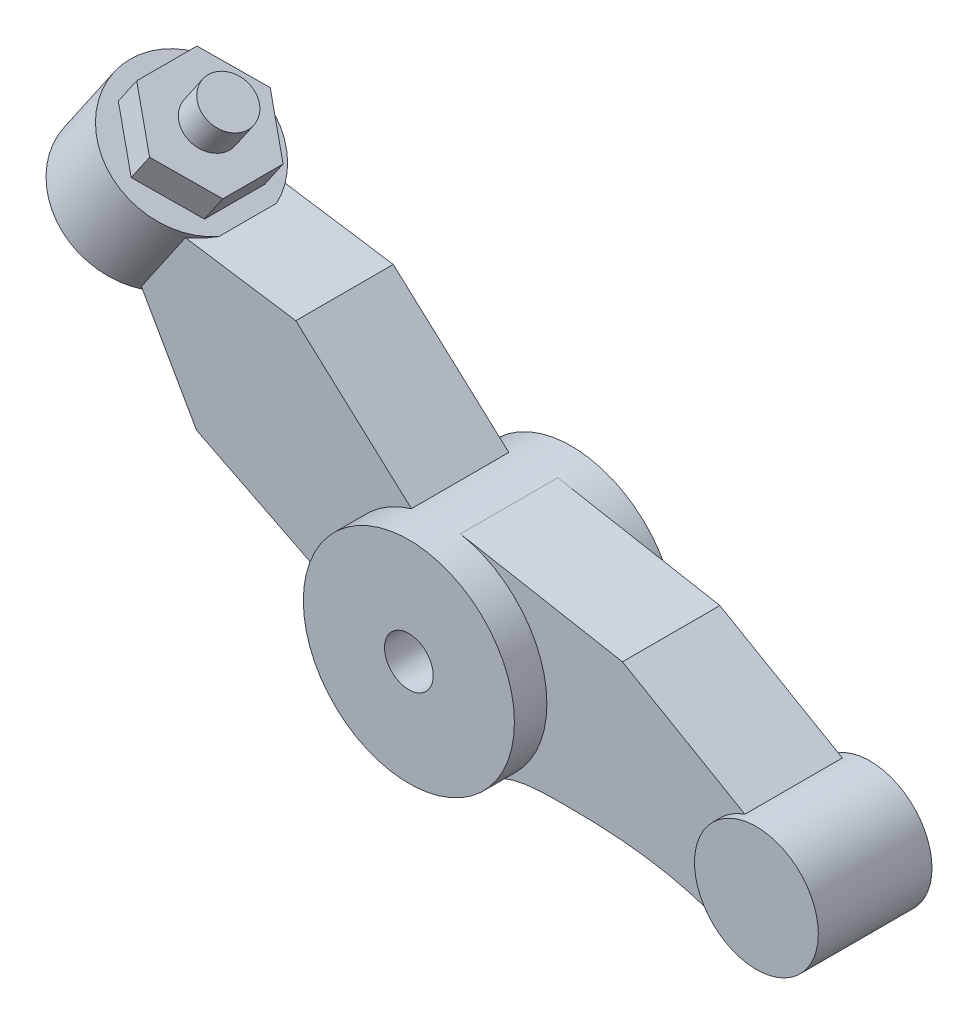
ISO-10303-21;
HEADER;
FILE_DESCRIPTION(('STEP AP214'),'2;1');
FILE_NAME('part.step','',(''),(''),'','','');
FILE_SCHEMA(('AUTOMOTIVE_DESIGN { 1 0 10303 214 1 1 1 1 }'));
ENDSEC;
DATA;
#1=APPLICATION_CONTEXT('core data for automotive mechanical design processes');
#2=APPLICATION_PROTOCOL_DEFINITION('international standard','automotive_design',2000,#1);
#3=PRODUCT_CONTEXT('',#1,'mechanical');
#4=PRODUCT('Part','Part','',(#3));
#5=PRODUCT_RELATED_PRODUCT_CATEGORY('part','',(#4));
#6=PRODUCT_DEFINITION_FORMATION('','',#4);
#7=PRODUCT_DEFINITION_CONTEXT('part definition',#1,'design');
#8=PRODUCT_DEFINITION('design','',#6,#7);
#9=PRODUCT_DEFINITION_SHAPE('','',#8);
#10=(LENGTH_UNIT() NAMED_UNIT(*) SI_UNIT(.MILLI.,.METRE.));
#11=(NAMED_UNIT(*) PLANE_ANGLE_UNIT() SI_UNIT($,.RADIAN.));
#12=(NAMED_UNIT(*) SI_UNIT($,.STERADIAN.) SOLID_ANGLE_UNIT());
#13=UNCERTAINTY_MEASURE_WITH_UNIT(LENGTH_MEASURE(1.E-05),#10,'distance_accuracy_value','');
#14=(GEOMETRIC_REPRESENTATION_CONTEXT(3) GLOBAL_UNCERTAINTY_ASSIGNED_CONTEXT((#13)) GLOBAL_UNIT_ASSIGNED_CONTEXT((#10,
#11,#12)) REPRESENTATION_CONTEXT('',''));
#15=CARTESIAN_POINT('',(0.,0.,0.));
#16=DIRECTION('',(0.,0.,1.));
#17=DIRECTION('',(1.,0.,0.));
#18=AXIS2_PLACEMENT_3D('',#15,#16,#17);
#19=CARTESIAN_POINT('',(-4.429411479515,3.71269787290576,0.));
#20=DIRECTION('',(0.565974647839503,0.824422645251178,0.));
#21=DIRECTION('',(-0.824422645251179,0.565974647839503,0.));
#22=AXIS2_PLACEMENT_3D('',#19,#20,#21);
#23=PLANE('',#22);
#24=CARTESIAN_POINT('',(-3.67671360440067,3.1959630194283,0.));
#25=DIRECTION('',(0.565974647839503,0.824422645251178,0.));
#26=DIRECTION('',(-0.824422645251179,0.565974647839503,0.));
#27=AXIS2_PLACEMENT_3D('',#24,#25,#26);
#28=CIRCLE('',#27,0.913);
#29=CARTESIAN_POINT('',(-2.98346453024075,2.72004038087295,-0.355629530954511));
#30=VERTEX_POINT('',#29);
#31=CARTESIAN_POINT('',(-2.98346453024075,2.72004038087295,0.355629530954511));
#32=VERTEX_POINT('',#31);
#33=EDGE_CURVE('E212',#30,#32,#28,.T.);
#34=ORIENTED_EDGE('',*,*,#33,.T.);
#35=DIRECTION('',(0.,0.,-1.));
#36=VECTOR('',#35,1.);
#37=CARTESIAN_POINT('',(-2.98346453024075,2.72004038087295,0.6));
#38=LINE('',#37,#36);
#39=EDGE_CURVE('E42',#32,#30,#38,.T.);
#40=ORIENTED_EDGE('',*,*,#39,.T.);
#41=EDGE_LOOP('',(#34,#40));
#42=FACE_BOUND('',#41,.T.);
#43=DIRECTION('',(0.713970954242686,-0.490148422926961,0.5));
#44=VECTOR('',#43,1.);
#45=CARTESIAN_POINT('',(-4.20707089900953,3.5600587714972,0.371413774928295));
#46=LINE('',#45,#44);
#47=CARTESIAN_POINT('',(-4.20707089900953,3.5600587714972,0.371413774928295));
#48=VERTEX_POINT('',#47);
#49=CARTESIAN_POINT('',(-3.67671360440067,3.1959630194283,0.742827549856588));
#50=VERTEX_POINT('',#49);
#51=EDGE_CURVE('E483',#48,#50,#46,.T.);
#52=ORIENTED_EDGE('',*,*,#51,.F.);
#53=DIRECTION('',(0.,0.,1.));
#54=VECTOR('',#53,1.);
#55=CARTESIAN_POINT('',(-4.20707089900953,3.5600587714972,-0.371413774928294));
#56=LINE('',#55,#54);
#57=CARTESIAN_POINT('',(-4.20707089900953,3.5600587714972,-0.371413774928294));
#58=VERTEX_POINT('',#57);
#59=EDGE_CURVE('E199',#58,#48,#56,.T.);
#60=ORIENTED_EDGE('',*,*,#59,.F.);
#61=DIRECTION('',(-0.713970954242686,0.490148422926961,0.5));
#62=VECTOR('',#61,1.);
#63=CARTESIAN_POINT('',(-3.67671360440067,3.1959630194283,-0.742827549856588));
#64=LINE('',#63,#62);
#65=CARTESIAN_POINT('',(-3.67671360440067,3.1959630194283,-0.742827549856588));
#66=VERTEX_POINT('',#65);
#67=EDGE_CURVE('E195',#66,#58,#64,.T.);
#68=ORIENTED_EDGE('',*,*,#67,.F.);
#69=DIRECTION('',(-0.713970954242687,0.490148422926961,-0.5));
#70=VECTOR('',#69,1.);
#71=CARTESIAN_POINT('',(-3.1463563097918,2.83186726735939,-0.371413774928294));
#72=LINE('',#71,#70);
#73=CARTESIAN_POINT('',(-3.1463563097918,2.83186726735939,-0.371413774928294));
#74=VERTEX_POINT('',#73);
#75=EDGE_CURVE('E498',#74,#66,#72,.T.);
#76=ORIENTED_EDGE('',*,*,#75,.F.);
#77=DIRECTION('',(0.,0.,-1.));
#78=VECTOR('',#77,1.);
#79=CARTESIAN_POINT('',(-3.1463563097918,2.83186726735939,0.371413774928294));
#80=LINE('',#79,#78);
#81=CARTESIAN_POINT('',(-3.1463563097918,2.83186726735939,0.371413774928294));
#82=VERTEX_POINT('',#81);
#83=EDGE_CURVE('E496',#82,#74,#80,.T.);
#84=ORIENTED_EDGE('',*,*,#83,.F.);
#85=DIRECTION('',(0.713970954242687,-0.490148422926961,-0.5));
#86=VECTOR('',#85,1.);
#87=CARTESIAN_POINT('',(-3.67671360440067,3.1959630194283,0.742827549856588));
#88=LINE('',#87,#86);
#89=EDGE_CURVE('E494',#50,#82,#88,.T.);
#90=ORIENTED_EDGE('',*,*,#89,.F.);
#91=EDGE_LOOP('',(#52,#60,#68,#76,#84,#90));
#92=FACE_BOUND('',#91,.T.);
#93=ADVANCED_FACE('F33',(#42,#92),#23,.T.);
#94=CARTESIAN_POINT('',(0.,0.,1.));
#95=DIRECTION('',(0.,0.,-1.));
#96=DIRECTION('',(-1.,0.,0.));
#97=AXIS2_PLACEMENT_3D('',#94,#95,#96);
#98=CYLINDRICAL_SURFACE('',#97,0.3);
#99=CARTESIAN_POINT('',(0.,0.,1.));
#100=DIRECTION('',(0.,0.,1.));
#101=DIRECTION('',(1.,0.,0.));
#102=AXIS2_PLACEMENT_3D('',#99,#100,#101);
#103=CIRCLE('',#102,0.3);
#104=CARTESIAN_POINT('',(0.3,0.,1.));
#105=VERTEX_POINT('',#104);
#106=EDGE_CURVE('E398',#105,#105,#103,.T.);
#107=ORIENTED_EDGE('',*,*,#106,.T.);
#108=EDGE_LOOP('',(#107));
#109=FACE_BOUND('',#108,.T.);
#110=CARTESIAN_POINT('',(0.,0.,-1.));
#111=DIRECTION('',(0.,0.,1.));
#112=DIRECTION('',(1.,0.,0.));
#113=AXIS2_PLACEMENT_3D('',#110,#111,#112);
#114=CIRCLE('',#113,0.3);
#115=CARTESIAN_POINT('',(0.3,0.,-1.));
#116=VERTEX_POINT('',#115);
#117=EDGE_CURVE('E397',#116,#116,#114,.T.);
#118=ORIENTED_EDGE('',*,*,#117,.F.);
#119=EDGE_LOOP('',(#118));
#120=FACE_BOUND('',#119,.T.);
#121=ADVANCED_FACE('F35',(#109,#120),#98,.F.);
#122=CARTESIAN_POINT('',(0.,0.,1.));
#123=DIRECTION('',(0.,0.,-1.));
#124=DIRECTION('',(-1.,0.,0.));
#125=AXIS2_PLACEMENT_3D('',#122,#123,#124);
#126=CYLINDRICAL_SURFACE('',#125,1.3);
#127=DIRECTION('',(0.,0.,-1.));
#128=VECTOR('',#127,1.);
#129=CARTESIAN_POINT('',(-0.368782160994087,1.24659525016444,0.6));
#130=LINE('',#129,#128);
#131=CARTESIAN_POINT('',(-0.368782160994086,1.24659525016444,0.6));
#132=VERTEX_POINT('',#131);
#133=CARTESIAN_POINT('',(-0.368782160994086,1.24659525016444,-0.6));
#134=VERTEX_POINT('',#133);
#135=EDGE_CURVE('E256',#132,#134,#130,.T.);
#136=ORIENTED_EDGE('',*,*,#135,.F.);
#137=CARTESIAN_POINT('',(0.,0.,0.6));
#138=DIRECTION('',(0.,0.,1.));
#139=DIRECTION('',(1.,0.,0.));
#140=AXIS2_PLACEMENT_3D('',#137,#138,#139);
#141=CIRCLE('',#140,1.3);
#142=CARTESIAN_POINT('',(-1.29584863415519,-0.103809042756995,0.6));
#143=VERTEX_POINT('',#142);
#144=EDGE_CURVE('E223',#132,#143,#141,.T.);
#145=ORIENTED_EDGE('',*,*,#144,.T.);
#146=DIRECTION('',(0.,0.,-1.));
#147=VECTOR('',#146,1.);
#148=CARTESIAN_POINT('',(-1.29584863415519,-0.103809042756995,0.6));
#149=LINE('',#148,#147);
#150=CARTESIAN_POINT('',(-1.29584863415519,-0.103809042756995,-0.6));
#151=VERTEX_POINT('',#150);
#152=EDGE_CURVE('E236',#143,#151,#149,.T.);
#153=ORIENTED_EDGE('',*,*,#152,.T.);
#154=CARTESIAN_POINT('',(0.,0.,-0.6));
#155=DIRECTION('',(0.,0.,1.));
#156=DIRECTION('',(1.,0.,0.));
#157=AXIS2_PLACEMENT_3D('',#154,#155,#156);
#158=CIRCLE('',#157,1.3);
#159=EDGE_CURVE('E237',#134,#151,#158,.T.);
#160=ORIENTED_EDGE('',*,*,#159,.F.);
#161=EDGE_LOOP('',(#136,#145,#153,#160));
#162=FACE_BOUND('',#161,.T.);
#163=DIRECTION('',(0.,0.,-1.));
#164=VECTOR('',#163,1.);
#165=CARTESIAN_POINT('',(0.670871310268431,-1.11352219782936,0.6));
#166=LINE('',#165,#164);
#167=CARTESIAN_POINT('',(0.670871310268431,-1.11352219782936,0.6));
#168=VERTEX_POINT('',#167);
#169=CARTESIAN_POINT('',(0.670871310268431,-1.11352219782936,-0.6));
#170=VERTEX_POINT('',#169);
#171=EDGE_CURVE('E386',#168,#170,#166,.T.);
#172=ORIENTED_EDGE('',*,*,#171,.F.);
#173=CARTESIAN_POINT('',(0.,0.,0.6));
#174=DIRECTION('',(0.,0.,1.));
#175=DIRECTION('',(1.,0.,0.));
#176=AXIS2_PLACEMENT_3D('',#173,#174,#175);
#177=CIRCLE('',#176,1.3);
#178=CARTESIAN_POINT('',(0.234346210183919,1.27870319221172,0.6));
#179=VERTEX_POINT('',#178);
#180=EDGE_CURVE('E388',#168,#179,#177,.T.);
#181=ORIENTED_EDGE('',*,*,#180,.T.);
#182=DIRECTION('',(0.,0.,-1.));
#183=VECTOR('',#182,1.);
#184=CARTESIAN_POINT('',(0.234346210183918,1.27870319221172,0.6));
#185=LINE('',#184,#183);
#186=CARTESIAN_POINT('',(0.234346210183918,1.27870319221172,-0.6));
#187=VERTEX_POINT('',#186);
#188=EDGE_CURVE('E374',#179,#187,#185,.T.);
#189=ORIENTED_EDGE('',*,*,#188,.T.);
#190=CARTESIAN_POINT('',(0.,0.,-0.6));
#191=DIRECTION('',(0.,0.,1.));
#192=DIRECTION('',(1.,0.,0.));
#193=AXIS2_PLACEMENT_3D('',#190,#191,#192);
#194=CIRCLE('',#193,1.3);
#195=EDGE_CURVE('E275',#170,#187,#194,.T.);
#196=ORIENTED_EDGE('',*,*,#195,.F.);
#197=EDGE_LOOP('',(#172,#181,#189,#196));
#198=FACE_BOUND('',#197,.T.);
#199=CARTESIAN_POINT('',(0.,0.,1.));
#200=DIRECTION('',(0.,0.,1.));
#201=DIRECTION('',(1.,0.,0.));
#202=AXIS2_PLACEMENT_3D('',#199,#200,#201);
#203=CIRCLE('',#202,1.3);
#204=CARTESIAN_POINT('',(1.3,0.,1.));
#205=VERTEX_POINT('',#204);
#206=EDGE_CURVE('E401',#205,#205,#203,.T.);
#207=ORIENTED_EDGE('',*,*,#206,.F.);
#208=EDGE_LOOP('',(#207));
#209=FACE_BOUND('',#208,.T.);
#210=CARTESIAN_POINT('',(0.,0.,-1.));
#211=DIRECTION('',(0.,0.,1.));
#212=DIRECTION('',(1.,0.,0.));
#213=AXIS2_PLACEMENT_3D('',#210,#211,#212);
#214=CIRCLE('',#213,1.3);
#215=CARTESIAN_POINT('',(1.3,0.,-1.));
#216=VERTEX_POINT('',#215);
#217=EDGE_CURVE('E402',#216,#216,#214,.T.);
#218=ORIENTED_EDGE('',*,*,#217,.T.);
#219=EDGE_LOOP('',(#218));
#220=FACE_BOUND('',#219,.T.);
#221=ADVANCED_FACE('F292',(#162,#198,#209,#220),#126,.T.);
#222=CARTESIAN_POINT('',(0.,0.,1.));
#223=DIRECTION('',(0.,0.,1.));
#224=DIRECTION('',(1.,0.,0.));
#225=AXIS2_PLACEMENT_3D('',#222,#223,#224);
#226=PLANE('',#225);
#227=ORIENTED_EDGE('',*,*,#106,.F.);
#228=EDGE_LOOP('',(#227));
#229=FACE_BOUND('',#228,.T.);
#230=ORIENTED_EDGE('',*,*,#206,.T.);
#231=EDGE_LOOP('',(#230));
#232=FACE_BOUND('',#231,.T.);
#233=ADVANCED_FACE('F289',(#229,#232),#226,.T.);
#234=CARTESIAN_POINT('',(0.,0.,-1.));
#235=DIRECTION('',(0.,0.,1.));
#236=DIRECTION('',(1.,0.,0.));
#237=AXIS2_PLACEMENT_3D('',#234,#235,#236);
#238=PLANE('',#237);
#239=ORIENTED_EDGE('',*,*,#117,.T.);
#240=EDGE_LOOP('',(#239));
#241=FACE_BOUND('',#240,.T.);
#242=ORIENTED_EDGE('',*,*,#217,.F.);
#243=EDGE_LOOP('',(#242));
#244=FACE_BOUND('',#243,.T.);
#245=ADVANCED_FACE('F286',(#241,#244),#238,.F.);
#246=CARTESIAN_POINT('',(3.53336564171573,-1.3,0.6));
#247=CARTESIAN_POINT('',(2.8535920389074,-1.01301427011385,0.6));
#248=CARTESIAN_POINT('',(1.91028957647874,-0.942153805001544,0.6));
#249=CARTESIAN_POINT('',(0.888636742859566,-0.98232357298077,0.6));
#250=CARTESIAN_POINT('',(0.670871310268431,-1.11352219782936,0.6));
#251=B_SPLINE_CURVE_WITH_KNOTS('',3,(#246,#247,#248,#249,#250),.UNSPECIFIED.,.F.,.F.,(4,1,4),
(0.,0.740050626201253,1.),.UNSPECIFIED.);
#252=DIRECTION('',(0.,0.,-1.));
#253=VECTOR('',#252,1.);
#254=SURFACE_OF_LINEAR_EXTRUSION('',#251,#253);
#255=CARTESIAN_POINT('',(3.53336564171573,-1.3,-0.6));
#256=CARTESIAN_POINT('',(2.8535920389074,-1.01301427011385,-0.6));
#257=CARTESIAN_POINT('',(1.91028957647874,-0.942153805001544,-0.6));
#258=CARTESIAN_POINT('',(0.888636742859566,-0.98232357298077,-0.6));
#259=CARTESIAN_POINT('',(0.670871310268431,-1.11352219782936,-0.6));
#260=B_SPLINE_CURVE_WITH_KNOTS('',3,(#255,#256,#257,#258,#259),.UNSPECIFIED.,.F.,.F.,(4,1,4),
(0.,0.740050626201253,1.),.UNSPECIFIED.);
#261=CARTESIAN_POINT('',(3.53336564171573,-1.3,-0.6));
#262=VERTEX_POINT('',#261);
#263=EDGE_CURVE('E267',#262,#170,#260,.T.);
#264=ORIENTED_EDGE('',*,*,#263,.F.);
#265=DIRECTION('',(0.,0.,-1.));
#266=VECTOR('',#265,1.);
#267=CARTESIAN_POINT('',(3.53336564171573,-1.3,0.6));
#268=LINE('',#267,#266);
#269=CARTESIAN_POINT('',(3.53336564171573,-1.3,0.6));
#270=VERTEX_POINT('',#269);
#271=EDGE_CURVE('E394',#270,#262,#268,.T.);
#272=ORIENTED_EDGE('',*,*,#271,.F.);
#273=EDGE_CURVE('E268',#270,#168,#251,.T.);
#274=ORIENTED_EDGE('',*,*,#273,.T.);
#275=ORIENTED_EDGE('',*,*,#171,.T.);
#276=EDGE_LOOP('',(#264,#272,#274,#275));
#277=FACE_BOUND('',#276,.T.);
#278=ADVANCED_FACE('F281',(#277),#254,.T.);
#279=CARTESIAN_POINT('',(0.954340385496315,1.65065356032909,0.6));
#280=DIRECTION('',(-0.500525078458484,-0.865722037281094,0.));
#281=DIRECTION('',(0.865722037281094,-0.500525078458484,0.));
#282=AXIS2_PLACEMENT_3D('',#279,#280,#281);
#283=PLANE('',#282);
#284=DIRECTION('',(-0.865722037281094,0.500525078458484,0.));
#285=VECTOR('',#284,1.);
#286=CARTESIAN_POINT('',(0.954340385496315,1.65065356032909,-0.6));
#287=LINE('',#286,#285);
#288=CARTESIAN_POINT('',(3.73819403416092,0.0411432257061033,-0.6));
#289=VERTEX_POINT('',#288);
#290=CARTESIAN_POINT('',(2.23039739242812,0.912889582969854,-0.6));
#291=VERTEX_POINT('',#290);
#292=EDGE_CURVE('E378',#289,#291,#287,.T.);
#293=ORIENTED_EDGE('',*,*,#292,.T.);
#294=DIRECTION('',(0.,0.,-1.));
#295=VECTOR('',#294,1.);
#296=CARTESIAN_POINT('',(2.23039739242812,0.912889582969854,0.6));
#297=LINE('',#296,#295);
#298=CARTESIAN_POINT('',(2.23039739242812,0.912889582969854,0.6));
#299=VERTEX_POINT('',#298);
#300=EDGE_CURVE('E376',#299,#291,#297,.T.);
#301=ORIENTED_EDGE('',*,*,#300,.F.);
#302=DIRECTION('',(-0.865722037281094,0.500525078458484,0.));
#303=VECTOR('',#302,1.);
#304=CARTESIAN_POINT('',(0.954340385496315,1.65065356032909,0.6));
#305=LINE('',#304,#303);
#306=CARTESIAN_POINT('',(3.73819403416092,0.0411432257061033,0.6));
#307=VERTEX_POINT('',#306);
#308=EDGE_CURVE('E715',#307,#299,#305,.T.);
#309=ORIENTED_EDGE('',*,*,#308,.F.);
#310=DIRECTION('',(0.,0.,-1.));
#311=VECTOR('',#310,1.);
#312=CARTESIAN_POINT('',(3.73819403416092,0.0411432257061033,0.6));
#313=LINE('',#312,#311);
#314=EDGE_CURVE('E391',#307,#289,#313,.T.);
#315=ORIENTED_EDGE('',*,*,#314,.T.);
#316=EDGE_LOOP('',(#293,#301,#309,#315));
#317=FACE_BOUND('',#316,.T.);
#318=ADVANCED_FACE('F285',(#317),#283,.F.);
#319=CARTESIAN_POINT('',(0.234346210183919,1.27870319221172,0.6));
#320=DIRECTION('',(-0.180266315526091,-0.983617840162859,0.));
#321=DIRECTION('',(0.983617840162859,-0.180266315526091,0.));
#322=AXIS2_PLACEMENT_3D('',#319,#320,#321);
#323=PLANE('',#322);
#324=DIRECTION('',(-0.983617840162859,0.180266315526091,0.));
#325=VECTOR('',#324,1.);
#326=CARTESIAN_POINT('',(0.234346210183919,1.27870319221172,-0.6));
#327=LINE('',#326,#325);
#328=EDGE_CURVE('E371',#291,#187,#327,.T.);
#329=ORIENTED_EDGE('',*,*,#328,.T.);
#330=ORIENTED_EDGE('',*,*,#188,.F.);
#331=DIRECTION('',(-0.983617840162859,0.180266315526091,0.));
#332=VECTOR('',#331,1.);
#333=CARTESIAN_POINT('',(0.234346210183919,1.27870319221172,0.6));
#334=LINE('',#333,#332);
#335=EDGE_CURVE('E713',#299,#179,#334,.T.);
#336=ORIENTED_EDGE('',*,*,#335,.F.);
#337=ORIENTED_EDGE('',*,*,#300,.T.);
#338=EDGE_LOOP('',(#329,#330,#336,#337));
#339=FACE_BOUND('',#338,.T.);
#340=ADVANCED_FACE('F357',(#339),#323,.F.);
#341=CARTESIAN_POINT('',(0.,0.,0.6));
#342=DIRECTION('',(0.,0.,1.));
#343=DIRECTION('',(1.,0.,0.));
#344=AXIS2_PLACEMENT_3D('',#341,#342,#343);
#345=PLANE('',#344);
#346=ORIENTED_EDGE('',*,*,#273,.F.);
#347=CARTESIAN_POINT('',(3.98,-0.682,0.6));
#348=DIRECTION('',(0.,0.,1.));
#349=DIRECTION('',(1.,0.,0.));
#350=AXIS2_PLACEMENT_3D('',#347,#348,#349);
#351=CIRCLE('',#350,0.7625);
#352=CARTESIAN_POINT('',(3.73763677181027,0.0409566485076774,0.6));
#353=VERTEX_POINT('',#352);
#354=EDGE_CURVE('E274',#353,#270,#351,.T.);
#355=ORIENTED_EDGE('',*,*,#354,.F.);
#356=DIRECTION('',(0.948262283007295,0.31748801965711,0.));
#357=VECTOR('',#356,1.);
#358=CARTESIAN_POINT('',(0.364418226221749,-1.08843180772527,0.6));
#359=LINE('',#358,#357);
#360=CARTESIAN_POINT('',(3.73791540298608,0.0410499371070543,0.6));
#361=VERTEX_POINT('',#360);
#362=EDGE_CURVE('E730',#353,#361,#359,.T.);
#363=ORIENTED_EDGE('',*,*,#362,.T.);
#364=CARTESIAN_POINT('',(3.98,-0.682,0.6));
#365=DIRECTION('',(0.,0.,1.));
#366=DIRECTION('',(1.,0.,0.));
#367=AXIS2_PLACEMENT_3D('',#364,#365,#366);
#368=CIRCLE('',#367,0.7625);
#369=EDGE_CURVE('E263',#361,#307,#368,.F.);
#370=ORIENTED_EDGE('',*,*,#369,.T.);
#371=ORIENTED_EDGE('',*,*,#308,.T.);
#372=ORIENTED_EDGE('',*,*,#335,.T.);
#373=ORIENTED_EDGE('',*,*,#180,.F.);
#374=EDGE_LOOP('',(#346,#355,#363,#370,#371,#372,#373));
#375=FACE_BOUND('',#374,.T.);
#376=ADVANCED_FACE('F354',(#375),#345,.T.);
#377=CARTESIAN_POINT('',(0.,0.,-0.6));
#378=DIRECTION('',(0.,0.,1.));
#379=DIRECTION('',(1.,0.,0.));
#380=AXIS2_PLACEMENT_3D('',#377,#378,#379);
#381=PLANE('',#380);
#382=ORIENTED_EDGE('',*,*,#263,.T.);
#383=ORIENTED_EDGE('',*,*,#195,.T.);
#384=ORIENTED_EDGE('',*,*,#328,.F.);
#385=ORIENTED_EDGE('',*,*,#292,.F.);
#386=DIRECTION('',(0.948262283007295,0.31748801965711,0.));
#387=VECTOR('',#386,1.);
#388=CARTESIAN_POINT('',(0.364418226221749,-1.08843180772527,-0.6));
#389=LINE('',#388,#387);
#390=CARTESIAN_POINT('',(3.73763677181027,0.0409566485076774,-0.6));
#391=VERTEX_POINT('',#390);
#392=EDGE_CURVE('E726',#391,#289,#389,.T.);
#393=ORIENTED_EDGE('',*,*,#392,.F.);
#394=CARTESIAN_POINT('',(3.98,-0.682,-0.6));
#395=DIRECTION('',(0.,0.,1.));
#396=DIRECTION('',(1.,0.,0.));
#397=AXIS2_PLACEMENT_3D('',#394,#395,#396);
#398=CIRCLE('',#397,0.7625);
#399=EDGE_CURVE('E709',#391,#262,#398,.T.);
#400=ORIENTED_EDGE('',*,*,#399,.T.);
#401=EDGE_LOOP('',(#382,#383,#384,#385,#393,#400));
#402=FACE_BOUND('',#401,.T.);
#403=ADVANCED_FACE('F352',(#402),#381,.F.);
#404=CARTESIAN_POINT('',(3.98,-0.682,0.7));
#405=DIRECTION('',(0.,0.,-1.));
#406=DIRECTION('',(-1.,0.,0.));
#407=AXIS2_PLACEMENT_3D('',#404,#405,#406);
#408=CYLINDRICAL_SURFACE('',#407,0.7625);
#409=ORIENTED_EDGE('',*,*,#362,.F.);
#410=ORIENTED_EDGE('',*,*,#354,.T.);
#411=ORIENTED_EDGE('',*,*,#271,.T.);
#412=ORIENTED_EDGE('',*,*,#399,.F.);
#413=ORIENTED_EDGE('',*,*,#392,.T.);
#414=ORIENTED_EDGE('',*,*,#314,.F.);
#415=ORIENTED_EDGE('',*,*,#369,.F.);
#416=EDGE_LOOP('',(#409,#410,#411,#412,#413,#414,#415));
#417=FACE_BOUND('',#416,.T.);
#418=CARTESIAN_POINT('',(3.98,-0.682,0.7));
#419=DIRECTION('',(0.,0.,1.));
#420=DIRECTION('',(1.,0.,0.));
#421=AXIS2_PLACEMENT_3D('',#418,#419,#420);
#422=CIRCLE('',#421,0.7625);
#423=CARTESIAN_POINT('',(4.7425,-0.682,0.7));
#424=VERTEX_POINT('',#423);
#425=EDGE_CURVE('E260',#424,#424,#422,.T.);
#426=ORIENTED_EDGE('',*,*,#425,.F.);
#427=EDGE_LOOP('',(#426));
#428=FACE_BOUND('',#427,.T.);
#429=CARTESIAN_POINT('',(3.98,-0.682,-0.7));
#430=DIRECTION('',(0.,0.,1.));
#431=DIRECTION('',(1.,0.,0.));
#432=AXIS2_PLACEMENT_3D('',#429,#430,#431);
#433=CIRCLE('',#432,0.7625);
#434=CARTESIAN_POINT('',(4.7425,-0.682,-0.7));
#435=VERTEX_POINT('',#434);
#436=EDGE_CURVE('E259',#435,#435,#433,.T.);
#437=ORIENTED_EDGE('',*,*,#436,.T.);
#438=EDGE_LOOP('',(#437));
#439=FACE_BOUND('',#438,.T.);
#440=ADVANCED_FACE('F345',(#417,#428,#439),#408,.T.);
#441=CARTESIAN_POINT('',(3.98,-0.682,0.7));
#442=DIRECTION('',(0.,0.,1.));
#443=DIRECTION('',(1.,0.,0.));
#444=AXIS2_PLACEMENT_3D('',#441,#442,#443);
#445=PLANE('',#444);
#446=ORIENTED_EDGE('',*,*,#425,.T.);
#447=EDGE_LOOP('',(#446));
#448=FACE_BOUND('',#447,.T.);
#449=ADVANCED_FACE('F342',(#448),#445,.T.);
#450=CARTESIAN_POINT('',(3.98,-0.682,-0.7));
#451=DIRECTION('',(0.,0.,1.));
#452=DIRECTION('',(1.,0.,0.));
#453=AXIS2_PLACEMENT_3D('',#450,#451,#452);
#454=PLANE('',#453);
#455=ORIENTED_EDGE('',*,*,#436,.F.);
#456=EDGE_LOOP('',(#455));
#457=FACE_BOUND('',#456,.T.);
#458=ADVANCED_FACE('F340',(#457),#454,.F.);
#459=CARTESIAN_POINT('',(0.453661048319221,0.499243278471414,0.6));
#460=DIRECTION('',(0.672513309674737,0.74008502775717,0.));
#461=DIRECTION('',(-0.74008502775717,0.672513309674738,0.));
#462=AXIS2_PLACEMENT_3D('',#459,#460,#461);
#463=PLANE('',#462);
#464=DIRECTION('',(0.74008502775717,-0.672513309674738,0.));
#465=VECTOR('',#464,1.);
#466=CARTESIAN_POINT('',(0.453661048319221,0.499243278471414,-0.6));
#467=LINE('',#466,#465);
#468=CARTESIAN_POINT('',(-1.79226124241245,2.5401069311108,-0.6));
#469=VERTEX_POINT('',#468);
#470=EDGE_CURVE('E240',#469,#134,#467,.T.);
#471=ORIENTED_EDGE('',*,*,#470,.F.);
#472=DIRECTION('',(0.,0.,-1.));
#473=VECTOR('',#472,1.);
#474=CARTESIAN_POINT('',(-1.79226124241245,2.5401069311108,0.6));
#475=LINE('',#474,#473);
#476=CARTESIAN_POINT('',(-1.79226124241245,2.5401069311108,0.6));
#477=VERTEX_POINT('',#476);
#478=EDGE_CURVE('E253',#477,#469,#475,.T.);
#479=ORIENTED_EDGE('',*,*,#478,.F.);
#480=DIRECTION('',(0.74008502775717,-0.672513309674738,0.));
#481=VECTOR('',#480,1.);
#482=CARTESIAN_POINT('',(0.453661048319221,0.499243278471414,0.6));
#483=LINE('',#482,#481);
#484=EDGE_CURVE('E225',#477,#132,#483,.T.);
#485=ORIENTED_EDGE('',*,*,#484,.T.);
#486=ORIENTED_EDGE('',*,*,#135,.T.);
#487=EDGE_LOOP('',(#471,#479,#485,#486));
#488=FACE_BOUND('',#487,.T.);
#489=ADVANCED_FACE('F336',(#488),#463,.T.);
#490=CARTESIAN_POINT('',(0.335147470046224,2.21875792830156,0.6));
#491=DIRECTION('',(0.149357531314737,0.988783256249603,0.));
#492=DIRECTION('',(-0.988783256249603,0.149357531314737,0.));
#493=AXIS2_PLACEMENT_3D('',#490,#491,#492);
#494=PLANE('',#493);
#495=CARTESIAN_POINT('',(-3.90760707276225,2.85963381336842,0.));
#496=DIRECTION('',(0.149357531314737,0.988783256249603,0.));
#497=DIRECTION('',(0.988783256249603,-0.149357531314737,0.));
#498=AXIS2_PLACEMENT_3D('',#495,#496,#497);
#499=ELLIPSE('',#498,1.01477381309275,0.913);
#500=CARTESIAN_POINT('',(-3.15131210571061,2.74539406617343,-0.6));
#501=VERTEX_POINT('',#500);
#502=EDGE_CURVE('E58',#30,#501,#499,.T.);
#503=ORIENTED_EDGE('',*,*,#502,.F.);
#504=ORIENTED_EDGE('',*,*,#39,.F.);
#505=CARTESIAN_POINT('',(-3.15131210571061,2.74539406617343,0.6));
#506=VERTEX_POINT('',#505);
#507=EDGE_CURVE('E221',#506,#32,#499,.T.);
#508=ORIENTED_EDGE('',*,*,#507,.F.);
#509=DIRECTION('',(0.988783256249603,-0.149357531314737,0.));
#510=VECTOR('',#509,1.);
#511=CARTESIAN_POINT('',(0.335147470046224,2.21875792830156,0.6));
#512=LINE('',#511,#510);
#513=EDGE_CURVE('E229',#506,#477,#512,.T.);
#514=ORIENTED_EDGE('',*,*,#513,.T.);
#515=ORIENTED_EDGE('',*,*,#478,.T.);
#516=DIRECTION('',(0.988783256249603,-0.149357531314737,0.));
#517=VECTOR('',#516,1.);
#518=CARTESIAN_POINT('',(0.335147470046224,2.21875792830156,-0.6));
#519=LINE('',#518,#517);
#520=EDGE_CURVE('E243',#501,#469,#519,.T.);
#521=ORIENTED_EDGE('',*,*,#520,.F.);
#522=EDGE_LOOP('',(#503,#504,#508,#514,#515,#521));
#523=FACE_BOUND('',#522,.T.);
#524=ADVANCED_FACE('F332',(#523),#494,.T.);
#525=CARTESIAN_POINT('',(-1.95012147704005,-1.11006161804942,0.6));
#526=DIRECTION('',(0.869066174166197,0.494695850922694,0.));
#527=DIRECTION('',(-0.494695850922694,0.869066174166198,0.));
#528=AXIS2_PLACEMENT_3D('',#525,#526,#527);
#529=PLANE('',#528);
#530=DIRECTION('',(0.,0.,-1.));
#531=VECTOR('',#530,1.);
#532=CARTESIAN_POINT('',(-3.64648340046694,1.87005386916173,0.6));
#533=LINE('',#532,#531);
#534=CARTESIAN_POINT('',(-3.64648340046694,1.87005386916173,0.48207474525172));
#535=VERTEX_POINT('',#534);
#536=CARTESIAN_POINT('',(-3.64648340046694,1.87005386916173,-0.48207474525172));
#537=VERTEX_POINT('',#536);
#538=EDGE_CURVE('E411',#535,#537,#533,.T.);
#539=ORIENTED_EDGE('',*,*,#538,.T.);
#540=CARTESIAN_POINT('',(-4.07280413326916,2.61900077771796,0.));
#541=DIRECTION('',(0.869066174166197,0.494695850922694,0.));
#542=DIRECTION('',(-0.494695850922694,0.869066174166198,0.));
#543=AXIS2_PLACEMENT_3D('',#540,#541,#542);
#544=ELLIPSE('',#543,1.01477381309274,0.913);
#545=CARTESIAN_POINT('',(-3.69442395752342,1.95427433802307,-0.6));
#546=VERTEX_POINT('',#545);
#547=EDGE_CURVE('E215',#537,#546,#544,.T.);
#548=ORIENTED_EDGE('',*,*,#547,.T.);
#549=DIRECTION('',(0.494695850922694,-0.869066174166197,0.));
#550=VECTOR('',#549,1.);
#551=CARTESIAN_POINT('',(-1.95012147704005,-1.11006161804942,-0.6));
#552=LINE('',#551,#550);
#553=CARTESIAN_POINT('',(-3.0144803813988,0.759770763252125,-0.6));
#554=VERTEX_POINT('',#553);
#555=EDGE_CURVE('E245',#546,#554,#552,.T.);
#556=ORIENTED_EDGE('',*,*,#555,.T.);
#557=DIRECTION('',(0.,0.,-1.));
#558=VECTOR('',#557,1.);
#559=CARTESIAN_POINT('',(-3.0144803813988,0.759770763252125,0.6));
#560=LINE('',#559,#558);
#561=CARTESIAN_POINT('',(-3.0144803813988,0.759770763252125,0.6));
#562=VERTEX_POINT('',#561);
#563=EDGE_CURVE('E250',#562,#554,#560,.T.);
#564=ORIENTED_EDGE('',*,*,#563,.F.);
#565=DIRECTION('',(0.494695850922694,-0.869066174166197,0.));
#566=VECTOR('',#565,1.);
#567=CARTESIAN_POINT('',(-1.95012147704005,-1.11006161804942,0.6));
#568=LINE('',#567,#566);
#569=CARTESIAN_POINT('',(-3.69442395752342,1.95427433802307,0.6));
#570=VERTEX_POINT('',#569);
#571=EDGE_CURVE('E231',#570,#562,#568,.T.);
#572=ORIENTED_EDGE('',*,*,#571,.F.);
#573=EDGE_CURVE('E218',#570,#535,#544,.T.);
#574=ORIENTED_EDGE('',*,*,#573,.T.);
#575=EDGE_LOOP('',(#539,#548,#556,#564,#572,#574));
#576=FACE_BOUND('',#575,.T.);
#577=ADVANCED_FACE('F328',(#576),#529,.F.);
#578=CARTESIAN_POINT('',(-0.302875131220134,-0.602759365542641,0.6));
#579=DIRECTION('',(0.448986214861667,0.893538683473857,0.));
#580=DIRECTION('',(-0.893538683473857,0.448986214861667,0.));
#581=AXIS2_PLACEMENT_3D('',#578,#579,#580);
#582=PLANE('',#581);
#583=DIRECTION('',(0.893538683473857,-0.448986214861667,0.));
#584=VECTOR('',#583,1.);
#585=CARTESIAN_POINT('',(-0.302875131220134,-0.602759365542641,-0.6));
#586=LINE('',#585,#584);
#587=EDGE_CURVE('E226',#554,#151,#586,.T.);
#588=ORIENTED_EDGE('',*,*,#587,.T.);
#589=ORIENTED_EDGE('',*,*,#152,.F.);
#590=DIRECTION('',(0.893538683473857,-0.448986214861667,0.));
#591=VECTOR('',#590,1.);
#592=CARTESIAN_POINT('',(-0.302875131220134,-0.602759365542641,0.6));
#593=LINE('',#592,#591);
#594=EDGE_CURVE('E233',#562,#143,#593,.T.);
#595=ORIENTED_EDGE('',*,*,#594,.F.);
#596=ORIENTED_EDGE('',*,*,#563,.T.);
#597=EDGE_LOOP('',(#588,#589,#595,#596));
#598=FACE_BOUND('',#597,.T.);
#599=ADVANCED_FACE('F321',(#598),#582,.F.);
#600=CARTESIAN_POINT('',(0.,0.,0.6));
#601=DIRECTION('',(0.,0.,1.));
#602=DIRECTION('',(1.,0.,0.));
#603=AXIS2_PLACEMENT_3D('',#600,#601,#602);
#604=PLANE('',#603);
#605=DIRECTION('',(0.565974647839503,0.824422645251178,0.));
#606=VECTOR('',#605,1.);
#607=CARTESIAN_POINT('',(-3.10937603300198,2.80647992598336,0.6));
#608=LINE('',#607,#606);
#609=EDGE_CURVE('E220',#570,#506,#608,.T.);
#610=ORIENTED_EDGE('',*,*,#609,.F.);
#611=ORIENTED_EDGE('',*,*,#571,.T.);
#612=ORIENTED_EDGE('',*,*,#594,.T.);
#613=ORIENTED_EDGE('',*,*,#144,.F.);
#614=ORIENTED_EDGE('',*,*,#484,.F.);
#615=ORIENTED_EDGE('',*,*,#513,.F.);
#616=EDGE_LOOP('',(#610,#611,#612,#613,#614,#615));
#617=FACE_BOUND('',#616,.T.);
#618=ADVANCED_FACE('F317',(#617),#604,.T.);
#619=CARTESIAN_POINT('',(0.,0.,-0.6));
#620=DIRECTION('',(0.,0.,1.));
#621=DIRECTION('',(1.,0.,0.));
#622=AXIS2_PLACEMENT_3D('',#619,#620,#621);
#623=PLANE('',#622);
#624=ORIENTED_EDGE('',*,*,#555,.F.);
#625=DIRECTION('',(0.565974647839503,0.824422645251178,0.));
#626=VECTOR('',#625,1.);
#627=CARTESIAN_POINT('',(-3.10937603300198,2.80647992598336,-0.6));
#628=LINE('',#627,#626);
#629=EDGE_CURVE('E405',#546,#501,#628,.T.);
#630=ORIENTED_EDGE('',*,*,#629,.T.);
#631=ORIENTED_EDGE('',*,*,#520,.T.);
#632=ORIENTED_EDGE('',*,*,#470,.T.);
#633=ORIENTED_EDGE('',*,*,#159,.T.);
#634=ORIENTED_EDGE('',*,*,#587,.F.);
#635=EDGE_LOOP('',(#624,#630,#631,#632,#633,#634));
#636=FACE_BOUND('',#635,.T.);
#637=ADVANCED_FACE('F320',(#636),#623,.F.);
#638=CARTESIAN_POINT('',(-4.28570232547598,2.30888425313803,0.));
#639=DIRECTION('',(-0.565974647839503,-0.824422645251178,0.));
#640=DIRECTION('',(0.824422645251179,-0.565974647839503,0.));
#641=AXIS2_PLACEMENT_3D('',#638,#639,#640);
#642=PLANE('',#641);
#643=CARTESIAN_POINT('',(-4.28570232547598,2.30888425313803,0.));
#644=DIRECTION('',(-0.565974647839503,-0.824422645251178,0.));
#645=DIRECTION('',(0.824422645251179,-0.565974647839503,0.));
#646=AXIS2_PLACEMENT_3D('',#643,#644,#645);
#647=CIRCLE('',#646,0.317996605484763);
#648=CARTESIAN_POINT('',(-4.02353872280133,2.12890623633463,0.));
#649=VERTEX_POINT('',#648);
#650=EDGE_CURVE('E37',#649,#649,#647,.F.);
#651=ORIENTED_EDGE('',*,*,#650,.T.);
#652=EDGE_LOOP('',(#651));
#653=FACE_BOUND('',#652,.T.);
#654=ORIENTED_EDGE('',*,*,#538,.F.);
#655=CARTESIAN_POINT('',(-4.28570232547598,2.30888425313803,0.));
#656=DIRECTION('',(0.565974647839503,0.824422645251178,0.));
#657=DIRECTION('',(-0.824422645251179,0.565974647839503,0.));
#658=AXIS2_PLACEMENT_3D('',#655,#656,#657);
#659=CIRCLE('',#658,0.912999999999999);
#660=EDGE_CURVE('E209',#537,#535,#659,.T.);
#661=ORIENTED_EDGE('',*,*,#660,.F.);
#662=EDGE_LOOP('',(#654,#661));
#663=FACE_BOUND('',#662,.T.);
#664=ADVANCED_FACE('F311',(#653,#663),#642,.T.);
#665=CARTESIAN_POINT('',(-3.67671360440067,3.1959630194283,0.));
#666=DIRECTION('',(0.565974647839503,0.824422645251178,0.));
#667=DIRECTION('',(-0.824422645251179,0.565974647839503,0.));
#668=AXIS2_PLACEMENT_3D('',#665,#666,#667);
#669=CYLINDRICAL_SURFACE('',#668,0.913);
#670=ORIENTED_EDGE('',*,*,#609,.T.);
#671=ORIENTED_EDGE('',*,*,#507,.T.);
#672=ORIENTED_EDGE('',*,*,#33,.F.);
#673=ORIENTED_EDGE('',*,*,#502,.T.);
#674=ORIENTED_EDGE('',*,*,#629,.F.);
#675=ORIENTED_EDGE('',*,*,#547,.F.);
#676=ORIENTED_EDGE('',*,*,#660,.T.);
#677=ORIENTED_EDGE('',*,*,#573,.F.);
#678=EDGE_LOOP('',(#670,#671,#672,#673,#674,#675,#676,#677));
#679=FACE_BOUND('',#678,.T.);
#680=ADVANCED_FACE('F313',(#679),#669,.T.);
#681=CARTESIAN_POINT('',(-4.46759219252869,2.04393576840924,0.));
#682=DIRECTION('',(0.565974647839503,0.824422645251179,0.));
#683=DIRECTION('',(-0.824422645251179,0.565974647839503,0.));
#684=AXIS2_PLACEMENT_3D('',#681,#682,#683);
#685=CONICAL_SURFACE('',#684,0.173276894584752,0.423115629790222);
#686=ORIENTED_EDGE('',*,*,#650,.F.);
#687=EDGE_LOOP('',(#686));
#688=FACE_BOUND('',#687,.T.);
#689=CARTESIAN_POINT('',(-4.46759219252869,2.04393576840924,0.));
#690=DIRECTION('',(0.565974647839503,0.824422645251179,0.));
#691=DIRECTION('',(-0.824422645251179,0.565974647839503,0.));
#692=AXIS2_PLACEMENT_3D('',#689,#690,#691);
#693=CIRCLE('',#692,0.173276894584752);
#694=CARTESIAN_POINT('',(-4.61044558832316,2.14200609780057,0.));
#695=VERTEX_POINT('',#694);
#696=EDGE_CURVE('E201',#695,#695,#693,.T.);
#697=ORIENTED_EDGE('',*,*,#696,.T.);
#698=EDGE_LOOP('',(#697));
#699=FACE_BOUND('',#698,.T.);
#700=ADVANCED_FACE('F316',(#688,#699),#685,.T.);
#701=CARTESIAN_POINT('',(-4.63970350821628,1.79323113579279,0.));
#702=DIRECTION('',(0.565974647839503,0.824422645251179,0.));
#703=DIRECTION('',(-0.824422645251179,0.565974647839503,0.));
#704=AXIS2_PLACEMENT_3D('',#701,#702,#703);
#705=SPHERICAL_SURFACE('',#704,0.35);
#706=ORIENTED_EDGE('',*,*,#696,.F.);
#707=EDGE_LOOP('',(#706));
#708=FACE_BOUND('',#707,.T.);
#709=ADVANCED_FACE('F440',(#708),#705,.T.);
#710=CARTESIAN_POINT('',(-3.98068103987373,3.88982782959767,-0.371413774928294));
#711=DIRECTION('',(0.824422645251178,-0.565974647839503,0.));
#712=DIRECTION('',(0.565974647839503,0.824422645251178,0.));
#713=AXIS2_PLACEMENT_3D('',#710,#711,#712);
#714=PLANE('',#713);
#715=ORIENTED_EDGE('',*,*,#59,.T.);
#716=DIRECTION('',(-0.565974647839503,-0.824422645251178,0.));
#717=VECTOR('',#716,1.);
#718=CARTESIAN_POINT('',(-3.98068103987373,3.88982782959767,0.371413774928295));
#719=LINE('',#718,#717);
#720=CARTESIAN_POINT('',(-3.98068103987373,3.88982782959767,0.371413774928295));
#721=VERTEX_POINT('',#720);
#722=EDGE_CURVE('E180',#721,#48,#719,.T.);
#723=ORIENTED_EDGE('',*,*,#722,.F.);
#724=DIRECTION('',(0.,0.,1.));
#725=VECTOR('',#724,1.);
#726=CARTESIAN_POINT('',(-3.98068103987373,3.88982782959767,-0.371413774928294));
#727=LINE('',#726,#725);
#728=CARTESIAN_POINT('',(-3.98068103987373,3.88982782959767,-0.371413774928294));
#729=VERTEX_POINT('',#728);
#730=EDGE_CURVE('E187',#729,#721,#727,.T.);
#731=ORIENTED_EDGE('',*,*,#730,.F.);
#732=DIRECTION('',(-0.565974647839503,-0.824422645251178,0.));
#733=VECTOR('',#732,1.);
#734=CARTESIAN_POINT('',(-3.98068103987373,3.88982782959767,-0.371413774928294));
#735=LINE('',#734,#733);
#736=EDGE_CURVE('E491',#729,#58,#735,.T.);
#737=ORIENTED_EDGE('',*,*,#736,.T.);
#738=EDGE_LOOP('',(#715,#723,#731,#737));
#739=FACE_BOUND('',#738,.T.);
#740=ADVANCED_FACE('F197',(#739),#714,.F.);
#741=CARTESIAN_POINT('',(-3.98068103987373,3.88982782959767,0.371413774928295));
#742=DIRECTION('',(0.412211322625589,-0.282987323919752,-0.866025403784438));
#743=DIRECTION('',(-0.902934052856612,0.,-0.429779124890835));
#744=AXIS2_PLACEMENT_3D('',#741,#742,#743);
#745=PLANE('',#744);
#746=ORIENTED_EDGE('',*,*,#51,.T.);
#747=DIRECTION('',(-0.565974647839503,-0.824422645251178,0.));
#748=VECTOR('',#747,1.);
#749=CARTESIAN_POINT('',(-3.45032374526487,3.52573207752877,0.742827549856588));
#750=LINE('',#749,#748);
#751=CARTESIAN_POINT('',(-3.45032374526487,3.52573207752877,0.742827549856588));
#752=VERTEX_POINT('',#751);
#753=EDGE_CURVE('E183',#752,#50,#750,.T.);
#754=ORIENTED_EDGE('',*,*,#753,.F.);
#755=DIRECTION('',(0.713970954242686,-0.490148422926961,0.5));
#756=VECTOR('',#755,1.);
#757=CARTESIAN_POINT('',(-3.98068103987373,3.88982782959767,0.371413774928295));
#758=LINE('',#757,#756);
#759=EDGE_CURVE('E176',#721,#752,#758,.T.);
#760=ORIENTED_EDGE('',*,*,#759,.F.);
#761=ORIENTED_EDGE('',*,*,#722,.T.);
#762=EDGE_LOOP('',(#746,#754,#760,#761));
#763=FACE_BOUND('',#762,.T.);
#764=ADVANCED_FACE('F178',(#763),#745,.F.);
#765=CARTESIAN_POINT('',(-3.45032374526487,3.52573207752877,0.742827549856588));
#766=DIRECTION('',(-0.412211322625589,0.282987323919752,-0.866025403784438));
#767=DIRECTION('',(-0.902934052856613,0.,0.429779124890835));
#768=AXIS2_PLACEMENT_3D('',#765,#766,#767);
#769=PLANE('',#768);
#770=ORIENTED_EDGE('',*,*,#89,.T.);
#771=DIRECTION('',(-0.565974647839503,-0.824422645251178,0.));
#772=VECTOR('',#771,1.);
#773=CARTESIAN_POINT('',(-2.919966450656,3.16163632545986,0.371413774928294));
#774=LINE('',#773,#772);
#775=CARTESIAN_POINT('',(-2.919966450656,3.16163632545986,0.371413774928294));
#776=VERTEX_POINT('',#775);
#777=EDGE_CURVE('E205',#776,#82,#774,.T.);
#778=ORIENTED_EDGE('',*,*,#777,.F.);
#779=DIRECTION('',(0.713970954242687,-0.490148422926961,-0.5));
#780=VECTOR('',#779,1.);
#781=CARTESIAN_POINT('',(-3.45032374526487,3.52573207752877,0.742827549856588));
#782=LINE('',#781,#780);
#783=EDGE_CURVE('E186',#752,#776,#782,.T.);
#784=ORIENTED_EDGE('',*,*,#783,.F.);
#785=ORIENTED_EDGE('',*,*,#753,.T.);
#786=EDGE_LOOP('',(#770,#778,#784,#785));
#787=FACE_BOUND('',#786,.T.);
#788=ADVANCED_FACE('F452',(#787),#769,.F.);
#789=CARTESIAN_POINT('',(-2.919966450656,3.16163632545986,0.371413774928294));
#790=DIRECTION('',(-0.824422645251178,0.565974647839503,0.));
#791=DIRECTION('',(-0.565974647839503,-0.824422645251178,0.));
#792=AXIS2_PLACEMENT_3D('',#789,#790,#791);
#793=PLANE('',#792);
#794=ORIENTED_EDGE('',*,*,#83,.T.);
#795=DIRECTION('',(-0.565974647839503,-0.824422645251178,0.));
#796=VECTOR('',#795,1.);
#797=CARTESIAN_POINT('',(-2.919966450656,3.16163632545986,-0.371413774928294));
#798=LINE('',#797,#796);
#799=CARTESIAN_POINT('',(-2.919966450656,3.16163632545986,-0.371413774928294));
#800=VERTEX_POINT('',#799);
#801=EDGE_CURVE('E503',#800,#74,#798,.T.);
#802=ORIENTED_EDGE('',*,*,#801,.F.);
#803=DIRECTION('',(0.,0.,-1.));
#804=VECTOR('',#803,1.);
#805=CARTESIAN_POINT('',(-2.919966450656,3.16163632545986,0.371413774928294));
#806=LINE('',#805,#804);
#807=EDGE_CURVE('E487',#776,#800,#806,.T.);
#808=ORIENTED_EDGE('',*,*,#807,.F.);
#809=ORIENTED_EDGE('',*,*,#777,.T.);
#810=EDGE_LOOP('',(#794,#802,#808,#809));
#811=FACE_BOUND('',#810,.T.);
#812=ADVANCED_FACE('F455',(#811),#793,.F.);
#813=CARTESIAN_POINT('',(-2.919966450656,3.16163632545986,-0.371413774928294));
#814=DIRECTION('',(-0.412211322625589,0.282987323919752,0.866025403784438));
#815=DIRECTION('',(0.902934052856612,0.,0.429779124890835));
#816=AXIS2_PLACEMENT_3D('',#813,#814,#815);
#817=PLANE('',#816);
#818=ORIENTED_EDGE('',*,*,#75,.T.);
#819=DIRECTION('',(-0.565974647839503,-0.824422645251178,0.));
#820=VECTOR('',#819,1.);
#821=CARTESIAN_POINT('',(-3.45032374526487,3.52573207752877,-0.742827549856588));
#822=LINE('',#821,#820);
#823=CARTESIAN_POINT('',(-3.45032374526487,3.52573207752877,-0.742827549856588));
#824=VERTEX_POINT('',#823);
#825=EDGE_CURVE('E50',#824,#66,#822,.T.);
#826=ORIENTED_EDGE('',*,*,#825,.F.);
#827=DIRECTION('',(-0.713970954242687,0.490148422926961,-0.5));
#828=VECTOR('',#827,1.);
#829=CARTESIAN_POINT('',(-2.919966450656,3.16163632545986,-0.371413774928294));
#830=LINE('',#829,#828);
#831=EDGE_CURVE('E489',#800,#824,#830,.T.);
#832=ORIENTED_EDGE('',*,*,#831,.F.);
#833=ORIENTED_EDGE('',*,*,#801,.T.);
#834=EDGE_LOOP('',(#818,#826,#832,#833));
#835=FACE_BOUND('',#834,.T.);
#836=ADVANCED_FACE('F459',(#835),#817,.F.);
#837=CARTESIAN_POINT('',(-3.45032374526487,3.52573207752877,-0.742827549856588));
#838=DIRECTION('',(0.412211322625589,-0.282987323919752,0.866025403784438));
#839=DIRECTION('',(0.902934052856612,0.,-0.429779124890835));
#840=AXIS2_PLACEMENT_3D('',#837,#838,#839);
#841=PLANE('',#840);
#842=ORIENTED_EDGE('',*,*,#67,.T.);
#843=ORIENTED_EDGE('',*,*,#736,.F.);
#844=DIRECTION('',(-0.713970954242686,0.490148422926961,0.5));
#845=VECTOR('',#844,1.);
#846=CARTESIAN_POINT('',(-3.45032374526487,3.52573207752877,-0.742827549856588));
#847=LINE('',#846,#845);
#848=EDGE_CURVE('E191',#824,#729,#847,.T.);
#849=ORIENTED_EDGE('',*,*,#848,.F.);
#850=ORIENTED_EDGE('',*,*,#825,.T.);
#851=EDGE_LOOP('',(#842,#843,#849,#850));
#852=FACE_BOUND('',#851,.T.);
#853=ADVANCED_FACE('F463',(#852),#841,.F.);
#854=CARTESIAN_POINT('',(0.539881857750834,0.78641478198557,0.));
#855=DIRECTION('',(0.565974647839504,0.824422645251178,0.));
#856=DIRECTION('',(-0.824422645251178,0.565974647839504,0.));
#857=AXIS2_PLACEMENT_3D('',#854,#855,#856);
#858=PLANE('',#857);
#859=CARTESIAN_POINT('',(-3.45032374526487,3.52573207752877,0.));
#860=DIRECTION('',(0.565974647839504,0.824422645251178,0.));
#861=DIRECTION('',(-0.824422645251178,0.565974647839504,0.));
#862=AXIS2_PLACEMENT_3D('',#859,#860,#861);
#863=CIRCLE('',#862,0.3);
#864=CARTESIAN_POINT('',(-3.69765053884022,3.69552447188062,0.));
#865=VERTEX_POINT('',#864);
#866=EDGE_CURVE('E11',#865,#865,#863,.T.);
#867=ORIENTED_EDGE('',*,*,#866,.F.);
#868=EDGE_LOOP('',(#867));
#869=FACE_BOUND('',#868,.T.);
#870=ORIENTED_EDGE('',*,*,#730,.T.);
#871=ORIENTED_EDGE('',*,*,#759,.T.);
#872=ORIENTED_EDGE('',*,*,#783,.T.);
#873=ORIENTED_EDGE('',*,*,#807,.T.);
#874=ORIENTED_EDGE('',*,*,#831,.T.);
#875=ORIENTED_EDGE('',*,*,#848,.T.);
#876=EDGE_LOOP('',(#870,#871,#872,#873,#874,#875));
#877=FACE_BOUND('',#876,.T.);
#878=ADVANCED_FACE('F190',(#869,#877),#858,.T.);
#879=CARTESIAN_POINT('',(-3.22393388612907,3.85550113562924,0.));
#880=DIRECTION('',(-0.565974647839504,-0.824422645251178,0.));
#881=DIRECTION('',(0.824422645251178,-0.565974647839504,0.));
#882=AXIS2_PLACEMENT_3D('',#879,#880,#881);
#883=CYLINDRICAL_SURFACE('',#882,0.3);
#884=CARTESIAN_POINT('',(-3.22393388612907,3.85550113562924,0.));
#885=DIRECTION('',(0.565974647839504,0.824422645251178,0.));
#886=DIRECTION('',(-0.824422645251178,0.565974647839504,0.));
#887=AXIS2_PLACEMENT_3D('',#884,#885,#886);
#888=CIRCLE('',#887,0.3);
#889=CARTESIAN_POINT('',(-3.47126067970442,4.02529352998109,0.));
#890=VERTEX_POINT('',#889);
#891=EDGE_CURVE('E481',#890,#890,#888,.T.);
#892=ORIENTED_EDGE('',*,*,#891,.F.);
#893=EDGE_LOOP('',(#892));
#894=FACE_BOUND('',#893,.T.);
#895=ORIENTED_EDGE('',*,*,#866,.T.);
#896=EDGE_LOOP('',(#895));
#897=FACE_BOUND('',#896,.T.);
#898=ADVANCED_FACE('F469',(#894,#897),#883,.T.);
#899=CARTESIAN_POINT('',(-3.22393388612907,3.85550113562924,0.));
#900=DIRECTION('',(0.565974647839504,0.824422645251178,0.));
#901=DIRECTION('',(-0.824422645251178,0.565974647839504,0.));
#902=AXIS2_PLACEMENT_3D('',#899,#900,#901);
#903=PLANE('',#902);
#904=ORIENTED_EDGE('',*,*,#891,.T.);
#905=EDGE_LOOP('',(#904));
#906=FACE_BOUND('',#905,.T.);
#907=ADVANCED_FACE('F473',(#906),#903,.T.);
#908=CLOSED_SHELL('',(#93,#121,#221,#233,#245,#278,#318,#340,#376,#403,#440,#449,#458,#489,#524,
#577,#599,#618,#637,#664,#680,#700,#709,#740,#764,#788,#812,#836,#853,#878,#898,#907));
#909=MANIFOLD_SOLID_BREP('B2',#908);
#910=ADVANCED_BREP_SHAPE_REPRESENTATION('',(#18,#909),#14);
#911=SHAPE_DEFINITION_REPRESENTATION(#9,#910);
ENDSEC;
END-ISO-10303-21;
